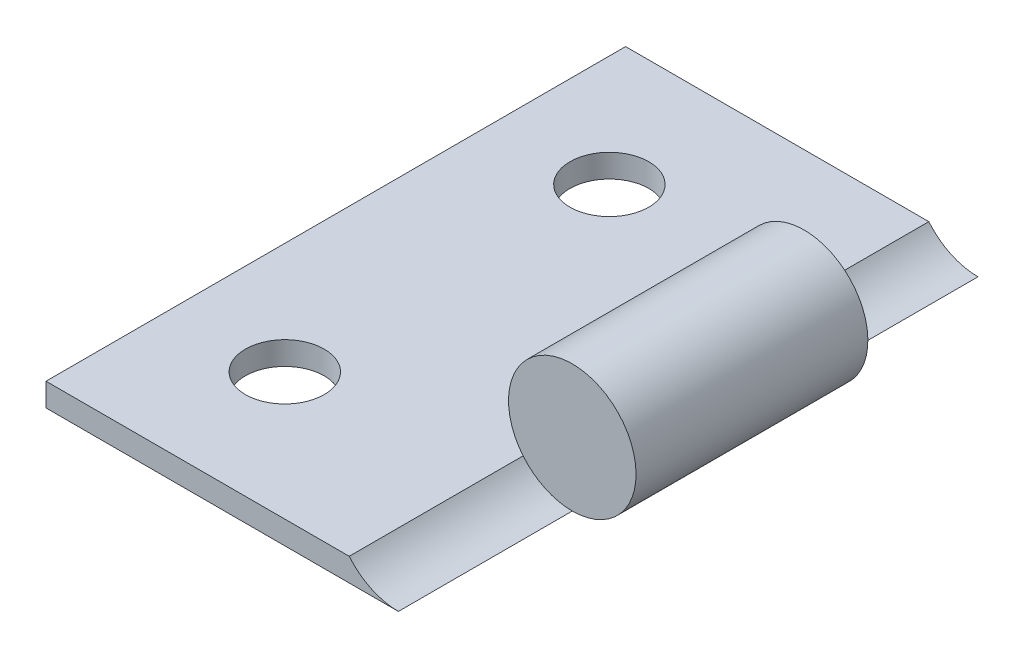
ISO-10303-21;
HEADER;
FILE_DESCRIPTION(('STEP AP214'),'2;1');
FILE_NAME('part.step','',(''),(''),'','','');
FILE_SCHEMA(('AUTOMOTIVE_DESIGN { 1 0 10303 214 1 1 1 1 }'));
ENDSEC;
DATA;
#1=APPLICATION_CONTEXT('core data for automotive mechanical design processes');
#2=APPLICATION_PROTOCOL_DEFINITION('international standard','automotive_design',2000,#1);
#3=PRODUCT_CONTEXT('',#1,'mechanical');
#4=PRODUCT('Part','Part','',(#3));
#5=PRODUCT_RELATED_PRODUCT_CATEGORY('part','',(#4));
#6=PRODUCT_DEFINITION_FORMATION('','',#4);
#7=PRODUCT_DEFINITION_CONTEXT('part definition',#1,'design');
#8=PRODUCT_DEFINITION('design','',#6,#7);
#9=PRODUCT_DEFINITION_SHAPE('','',#8);
#10=(LENGTH_UNIT() NAMED_UNIT(*) SI_UNIT(.MILLI.,.METRE.));
#11=(NAMED_UNIT(*) PLANE_ANGLE_UNIT() SI_UNIT($,.RADIAN.));
#12=(NAMED_UNIT(*) SI_UNIT($,.STERADIAN.) SOLID_ANGLE_UNIT());
#13=UNCERTAINTY_MEASURE_WITH_UNIT(LENGTH_MEASURE(1.E-05),#10,'distance_accuracy_value','');
#14=(GEOMETRIC_REPRESENTATION_CONTEXT(3) GLOBAL_UNCERTAINTY_ASSIGNED_CONTEXT((#13)) GLOBAL_UNIT_ASSIGNED_CONTEXT((#10,
#11,#12)) REPRESENTATION_CONTEXT('',''));
#15=CARTESIAN_POINT('',(0.,0.,0.));
#16=DIRECTION('',(0.,0.,1.));
#17=DIRECTION('',(1.,0.,0.));
#18=AXIS2_PLACEMENT_3D('',#15,#16,#17);
#19=CARTESIAN_POINT('',(0.,0.,25.));
#20=DIRECTION('',(0.,0.,-1.));
#21=DIRECTION('',(-1.,0.,0.));
#22=AXIS2_PLACEMENT_3D('',#19,#20,#21);
#23=CYLINDRICAL_SURFACE('',#22,2.75);
#24=CARTESIAN_POINT('',(0.,0.,17.5));
#25=DIRECTION('',(0.,0.,1.));
#26=DIRECTION('',(1.,0.,0.));
#27=AXIS2_PLACEMENT_3D('',#24,#25,#26);
#28=CIRCLE('',#27,2.75);
#29=CARTESIAN_POINT('',(0.,-2.75,17.5));
#30=VERTEX_POINT('',#29);
#31=CARTESIAN_POINT('',(-2.12132034355964,-1.75,17.5));
#32=VERTEX_POINT('',#31);
#33=EDGE_CURVE('E98',#30,#32,#28,.T.);
#34=ORIENTED_EDGE('',*,*,#33,.F.);
#35=DIRECTION('',(0.,0.,-1.));
#36=VECTOR('',#35,1.);
#37=CARTESIAN_POINT('',(0.,-2.75,25.));
#38=LINE('',#37,#36);
#39=CARTESIAN_POINT('',(0.,-2.75,7.5));
#40=VERTEX_POINT('',#39);
#41=EDGE_CURVE('E132',#30,#40,#38,.T.);
#42=ORIENTED_EDGE('',*,*,#41,.T.);
#43=CARTESIAN_POINT('',(0.,0.,7.5));
#44=DIRECTION('',(0.,0.,-1.));
#45=DIRECTION('',(-1.,0.,0.));
#46=AXIS2_PLACEMENT_3D('',#43,#44,#45);
#47=CIRCLE('',#46,2.75);
#48=CARTESIAN_POINT('',(-2.12132034355964,-1.75,7.5));
#49=VERTEX_POINT('',#48);
#50=EDGE_CURVE('E112',#49,#40,#47,.T.);
#51=ORIENTED_EDGE('',*,*,#50,.F.);
#52=DIRECTION('',(0.,0.,-1.));
#53=VECTOR('',#52,1.);
#54=CARTESIAN_POINT('',(-2.12132034355964,-1.75,25.));
#55=LINE('',#54,#53);
#56=EDGE_CURVE('E43',#32,#49,#55,.T.);
#57=ORIENTED_EDGE('',*,*,#56,.F.);
#58=EDGE_LOOP('',(#34,#42,#51,#57));
#59=FACE_BOUND('',#58,.T.);
#60=ADVANCED_FACE('F34',(#59),#23,.T.);
#61=CARTESIAN_POINT('',(-15.2,-1.75000000000001,25.));
#62=DIRECTION('',(0.,-1.,0.));
#63=DIRECTION('',(1.,0.,0.));
#64=AXIS2_PLACEMENT_3D('',#61,#62,#63);
#65=PLANE('',#64);
#66=CARTESIAN_POINT('',(-10.4,-1.75000000000001,5.5));
#67=DIRECTION('',(0.,1.,0.));
#68=DIRECTION('',(-1.,0.,0.));
#69=AXIS2_PLACEMENT_3D('',#66,#67,#68);
#70=CIRCLE('',#69,1.7);
#71=CARTESIAN_POINT('',(-12.1,-1.75000000000001,5.5));
#72=VERTEX_POINT('',#71);
#73=EDGE_CURVE('E141',#72,#72,#70,.T.);
#74=ORIENTED_EDGE('',*,*,#73,.F.);
#75=EDGE_LOOP('',(#74));
#76=FACE_BOUND('',#75,.T.);
#77=CARTESIAN_POINT('',(-10.4,-1.75000000000001,19.5));
#78=DIRECTION('',(0.,1.,0.));
#79=DIRECTION('',(1.,0.,0.));
#80=AXIS2_PLACEMENT_3D('',#77,#78,#79);
#81=CIRCLE('',#80,1.7);
#82=CARTESIAN_POINT('',(-8.7,-1.75,19.5));
#83=VERTEX_POINT('',#82);
#84=EDGE_CURVE('E128',#83,#83,#81,.T.);
#85=ORIENTED_EDGE('',*,*,#84,.F.);
#86=EDGE_LOOP('',(#85));
#87=FACE_BOUND('',#86,.T.);
#88=DIRECTION('',(-1.,0.,0.));
#89=VECTOR('',#88,1.);
#90=CARTESIAN_POINT('',(-15.2,-1.75000000000001,0.));
#91=LINE('',#90,#89);
#92=CARTESIAN_POINT('',(-2.12132034355964,-1.75,0.));
#93=VERTEX_POINT('',#92);
#94=CARTESIAN_POINT('',(-15.2,-1.75000000000001,0.));
#95=VERTEX_POINT('',#94);
#96=EDGE_CURVE('E133',#93,#95,#91,.T.);
#97=ORIENTED_EDGE('',*,*,#96,.T.);
#98=DIRECTION('',(0.,0.,-1.));
#99=VECTOR('',#98,1.);
#100=CARTESIAN_POINT('',(-15.2,-1.75000000000001,25.));
#101=LINE('',#100,#99);
#102=CARTESIAN_POINT('',(-15.2,-1.75000000000001,25.));
#103=VERTEX_POINT('',#102);
#104=EDGE_CURVE('E116',#103,#95,#101,.T.);
#105=ORIENTED_EDGE('',*,*,#104,.F.);
#106=DIRECTION('',(-1.,0.,0.));
#107=VECTOR('',#106,1.);
#108=CARTESIAN_POINT('',(-15.2,-1.75000000000001,25.));
#109=LINE('',#108,#107);
#110=CARTESIAN_POINT('',(-2.12132034355964,-1.75,25.));
#111=VERTEX_POINT('',#110);
#112=EDGE_CURVE('E120',#111,#103,#109,.T.);
#113=ORIENTED_EDGE('',*,*,#112,.F.);
#114=EDGE_CURVE('E11',#111,#32,#55,.T.);
#115=ORIENTED_EDGE('',*,*,#114,.T.);
#116=ORIENTED_EDGE('',*,*,#56,.T.);
#117=DIRECTION('',(0.,0.,-1.));
#118=VECTOR('',#117,1.);
#119=CARTESIAN_POINT('',(-2.12132034355964,-1.75,7.5));
#120=LINE('',#119,#118);
#121=EDGE_CURVE('E149',#49,#93,#120,.T.);
#122=ORIENTED_EDGE('',*,*,#121,.T.);
#123=EDGE_LOOP('',(#97,#105,#113,#115,#116,#122));
#124=FACE_BOUND('',#123,.T.);
#125=ADVANCED_FACE('F118',(#76,#87,#124),#65,.F.);
#126=CARTESIAN_POINT('',(-15.2,-2.75000000000001,25.));
#127=DIRECTION('',(1.,0.,0.));
#128=DIRECTION('',(0.,1.,0.));
#129=AXIS2_PLACEMENT_3D('',#126,#127,#128);
#130=PLANE('',#129);
#131=DIRECTION('',(0.,-1.,0.));
#132=VECTOR('',#131,1.);
#133=CARTESIAN_POINT('',(-15.2,-2.75000000000001,0.));
#134=LINE('',#133,#132);
#135=CARTESIAN_POINT('',(-15.2,-2.75000000000001,0.));
#136=VERTEX_POINT('',#135);
#137=EDGE_CURVE('E66',#95,#136,#134,.T.);
#138=ORIENTED_EDGE('',*,*,#137,.T.);
#139=DIRECTION('',(0.,0.,-1.));
#140=VECTOR('',#139,1.);
#141=CARTESIAN_POINT('',(-15.2,-2.75000000000001,25.));
#142=LINE('',#141,#140);
#143=CARTESIAN_POINT('',(-15.2,-2.75000000000001,25.));
#144=VERTEX_POINT('',#143);
#145=EDGE_CURVE('E137',#144,#136,#142,.T.);
#146=ORIENTED_EDGE('',*,*,#145,.F.);
#147=DIRECTION('',(0.,-1.,0.));
#148=VECTOR('',#147,1.);
#149=CARTESIAN_POINT('',(-15.2,-2.75000000000001,25.));
#150=LINE('',#149,#148);
#151=EDGE_CURVE('E52',#103,#144,#150,.T.);
#152=ORIENTED_EDGE('',*,*,#151,.F.);
#153=ORIENTED_EDGE('',*,*,#104,.T.);
#154=EDGE_LOOP('',(#138,#146,#152,#153));
#155=FACE_BOUND('',#154,.T.);
#156=ADVANCED_FACE('F168',(#155),#130,.F.);
#157=CARTESIAN_POINT('',(0.,-2.75,25.));
#158=DIRECTION('',(0.,1.,0.));
#159=DIRECTION('',(-1.,0.,0.));
#160=AXIS2_PLACEMENT_3D('',#157,#158,#159);
#161=PLANE('',#160);
#162=CARTESIAN_POINT('',(-10.4,-2.75,5.5));
#163=DIRECTION('',(0.,1.,0.));
#164=DIRECTION('',(-1.,0.,0.));
#165=AXIS2_PLACEMENT_3D('',#162,#163,#164);
#166=CIRCLE('',#165,1.7);
#167=CARTESIAN_POINT('',(-12.1,-2.75,5.5));
#168=VERTEX_POINT('',#167);
#169=EDGE_CURVE('E37',#168,#168,#166,.T.);
#170=ORIENTED_EDGE('',*,*,#169,.T.);
#171=EDGE_LOOP('',(#170));
#172=FACE_BOUND('',#171,.T.);
#173=CARTESIAN_POINT('',(-10.4,-2.75,19.5));
#174=DIRECTION('',(0.,1.,0.));
#175=DIRECTION('',(-1.,0.,0.));
#176=AXIS2_PLACEMENT_3D('',#173,#174,#175);
#177=CIRCLE('',#176,1.7);
#178=CARTESIAN_POINT('',(-12.1,-2.75,19.5));
#179=VERTEX_POINT('',#178);
#180=EDGE_CURVE('E139',#179,#179,#177,.T.);
#181=ORIENTED_EDGE('',*,*,#180,.T.);
#182=EDGE_LOOP('',(#181));
#183=FACE_BOUND('',#182,.T.);
#184=DIRECTION('',(1.,0.,0.));
#185=VECTOR('',#184,1.);
#186=CARTESIAN_POINT('',(0.,-2.75,0.));
#187=LINE('',#186,#185);
#188=CARTESIAN_POINT('',(0.,-2.75,0.));
#189=VERTEX_POINT('',#188);
#190=EDGE_CURVE('E121',#136,#189,#187,.T.);
#191=ORIENTED_EDGE('',*,*,#190,.T.);
#192=DIRECTION('',(0.,0.,-1.));
#193=VECTOR('',#192,1.);
#194=CARTESIAN_POINT('',(0.,-2.75,7.5));
#195=LINE('',#194,#193);
#196=EDGE_CURVE('E73',#40,#189,#195,.T.);
#197=ORIENTED_EDGE('',*,*,#196,.F.);
#198=ORIENTED_EDGE('',*,*,#41,.F.);
#199=CARTESIAN_POINT('',(0.,-2.75,25.));
#200=VERTEX_POINT('',#199);
#201=EDGE_CURVE('E108',#200,#30,#38,.T.);
#202=ORIENTED_EDGE('',*,*,#201,.F.);
#203=DIRECTION('',(1.,0.,0.));
#204=VECTOR('',#203,1.);
#205=CARTESIAN_POINT('',(0.,-2.75,25.));
#206=LINE('',#205,#204);
#207=EDGE_CURVE('E123',#144,#200,#206,.T.);
#208=ORIENTED_EDGE('',*,*,#207,.F.);
#209=ORIENTED_EDGE('',*,*,#145,.T.);
#210=EDGE_LOOP('',(#191,#197,#198,#202,#208,#209));
#211=FACE_BOUND('',#210,.T.);
#212=ADVANCED_FACE('F160',(#172,#183,#211),#161,.F.);
#213=CARTESIAN_POINT('',(0.,0.,25.));
#214=DIRECTION('',(0.,0.,1.));
#215=DIRECTION('',(1.,0.,0.));
#216=AXIS2_PLACEMENT_3D('',#213,#214,#215);
#217=PLANE('',#216);
#218=CARTESIAN_POINT('',(0.,0.,25.));
#219=DIRECTION('',(0.,0.,1.));
#220=DIRECTION('',(1.,0.,0.));
#221=AXIS2_PLACEMENT_3D('',#218,#219,#220);
#222=CIRCLE('',#221,2.75);
#223=EDGE_CURVE('E104',#111,#200,#222,.T.);
#224=ORIENTED_EDGE('',*,*,#223,.F.);
#225=ORIENTED_EDGE('',*,*,#112,.T.);
#226=ORIENTED_EDGE('',*,*,#151,.T.);
#227=ORIENTED_EDGE('',*,*,#207,.T.);
#228=EDGE_LOOP('',(#224,#225,#226,#227));
#229=FACE_BOUND('',#228,.T.);
#230=ADVANCED_FACE('F158',(#229),#217,.T.);
#231=CARTESIAN_POINT('',(0.,0.,0.));
#232=DIRECTION('',(0.,0.,1.));
#233=DIRECTION('',(1.,0.,0.));
#234=AXIS2_PLACEMENT_3D('',#231,#232,#233);
#235=PLANE('',#234);
#236=ORIENTED_EDGE('',*,*,#96,.F.);
#237=CARTESIAN_POINT('',(0.,0.,0.));
#238=DIRECTION('',(0.,0.,-1.));
#239=DIRECTION('',(-1.,0.,0.));
#240=AXIS2_PLACEMENT_3D('',#237,#238,#239);
#241=CIRCLE('',#240,2.75);
#242=EDGE_CURVE('E109',#189,#93,#241,.T.);
#243=ORIENTED_EDGE('',*,*,#242,.F.);
#244=ORIENTED_EDGE('',*,*,#190,.F.);
#245=ORIENTED_EDGE('',*,*,#137,.F.);
#246=EDGE_LOOP('',(#236,#243,#244,#245));
#247=FACE_BOUND('',#246,.T.);
#248=ADVANCED_FACE('F166',(#247),#235,.F.);
#249=CARTESIAN_POINT('',(-10.4,-26.75,19.5));
#250=DIRECTION('',(0.,1.,0.));
#251=DIRECTION('',(-1.,0.,0.));
#252=AXIS2_PLACEMENT_3D('',#249,#250,#251);
#253=CYLINDRICAL_SURFACE('',#252,1.7);
#254=ORIENTED_EDGE('',*,*,#84,.T.);
#255=EDGE_LOOP('',(#254));
#256=FACE_BOUND('',#255,.T.);
#257=ORIENTED_EDGE('',*,*,#180,.F.);
#258=EDGE_LOOP('',(#257));
#259=FACE_BOUND('',#258,.T.);
#260=ADVANCED_FACE('F231',(#256,#259),#253,.F.);
#261=CARTESIAN_POINT('',(-10.4,-26.75,5.5));
#262=DIRECTION('',(0.,1.,0.));
#263=DIRECTION('',(-1.,0.,0.));
#264=AXIS2_PLACEMENT_3D('',#261,#262,#263);
#265=CYLINDRICAL_SURFACE('',#264,1.7);
#266=ORIENTED_EDGE('',*,*,#73,.T.);
#267=EDGE_LOOP('',(#266));
#268=FACE_BOUND('',#267,.T.);
#269=ORIENTED_EDGE('',*,*,#169,.F.);
#270=EDGE_LOOP('',(#269));
#271=FACE_BOUND('',#270,.T.);
#272=ADVANCED_FACE('F228',(#268,#271),#265,.F.);
#273=CARTESIAN_POINT('',(0.,0.,7.5));
#274=DIRECTION('',(0.,0.,-1.));
#275=DIRECTION('',(-1.,0.,0.));
#276=AXIS2_PLACEMENT_3D('',#273,#274,#275);
#277=CYLINDRICAL_SURFACE('',#276,2.75);
#278=EDGE_CURVE('E153',#40,#49,#47,.T.);
#279=ORIENTED_EDGE('',*,*,#278,.F.);
#280=ORIENTED_EDGE('',*,*,#196,.T.);
#281=ORIENTED_EDGE('',*,*,#242,.T.);
#282=ORIENTED_EDGE('',*,*,#121,.F.);
#283=EDGE_LOOP('',(#279,#280,#281,#282));
#284=FACE_BOUND('',#283,.T.);
#285=ADVANCED_FACE('F163',(#284),#277,.F.);
#286=CARTESIAN_POINT('',(0.,0.,7.5));
#287=DIRECTION('',(0.,0.,-1.));
#288=DIRECTION('',(-1.,0.,0.));
#289=AXIS2_PLACEMENT_3D('',#286,#287,#288);
#290=PLANE('',#289);
#291=ORIENTED_EDGE('',*,*,#278,.T.);
#292=ORIENTED_EDGE('',*,*,#50,.T.);
#293=EDGE_LOOP('',(#291,#292));
#294=FACE_BOUND('',#293,.T.);
#295=ADVANCED_FACE('F162',(#294),#290,.T.);
#296=CARTESIAN_POINT('',(0.,0.,17.5));
#297=DIRECTION('',(0.,0.,1.));
#298=DIRECTION('',(1.,0.,0.));
#299=AXIS2_PLACEMENT_3D('',#296,#297,#298);
#300=CYLINDRICAL_SURFACE('',#299,2.75);
#301=ORIENTED_EDGE('',*,*,#223,.T.);
#302=ORIENTED_EDGE('',*,*,#201,.T.);
#303=EDGE_CURVE('E100',#32,#30,#28,.T.);
#304=ORIENTED_EDGE('',*,*,#303,.F.);
#305=ORIENTED_EDGE('',*,*,#114,.F.);
#306=EDGE_LOOP('',(#301,#302,#304,#305));
#307=FACE_BOUND('',#306,.T.);
#308=ADVANCED_FACE('F106',(#307),#300,.F.);
#309=CARTESIAN_POINT('',(0.,0.,17.5));
#310=DIRECTION('',(0.,0.,1.));
#311=DIRECTION('',(1.,0.,0.));
#312=AXIS2_PLACEMENT_3D('',#309,#310,#311);
#313=PLANE('',#312);
#314=ORIENTED_EDGE('',*,*,#303,.T.);
#315=ORIENTED_EDGE('',*,*,#33,.T.);
#316=EDGE_LOOP('',(#314,#315));
#317=FACE_BOUND('',#316,.T.);
#318=ADVANCED_FACE('F99',(#317),#313,.T.);
#319=CLOSED_SHELL('',(#60,#125,#156,#212,#230,#248,#260,#272,#285,#295,#308,#318));
#320=MANIFOLD_SOLID_BREP('B2',#319);
#321=ADVANCED_BREP_SHAPE_REPRESENTATION('',(#18,#320),#14);
#322=SHAPE_DEFINITION_REPRESENTATION(#9,#321);
ENDSEC;
END-ISO-10303-21;
